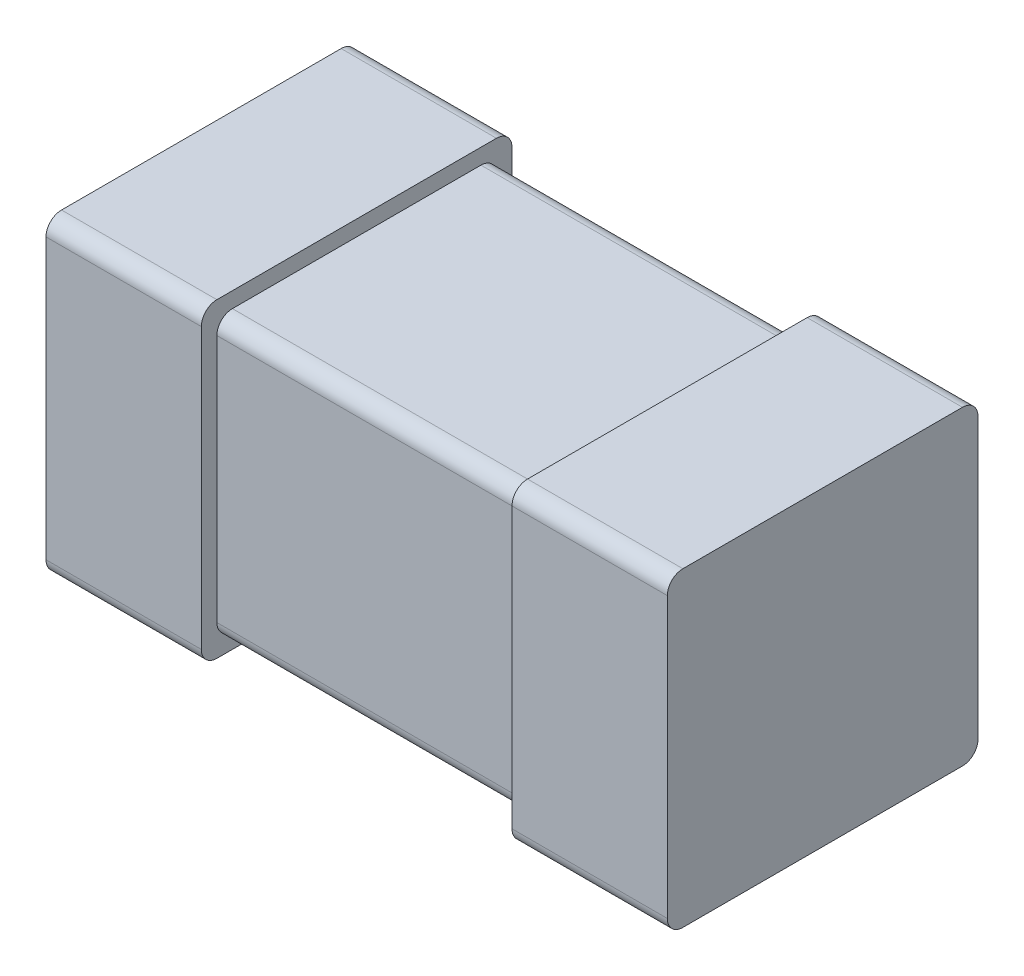
ISO-10303-21;
HEADER;
FILE_DESCRIPTION(('STEP AP214'),'2;1');
FILE_NAME('part.step','',(''),(''),'','','');
FILE_SCHEMA(('AUTOMOTIVE_DESIGN { 1 0 10303 214 1 1 1 1 }'));
ENDSEC;
DATA;
#1=APPLICATION_CONTEXT('core data for automotive mechanical design processes');
#2=APPLICATION_PROTOCOL_DEFINITION('international standard','automotive_design',2000,#1);
#3=PRODUCT_CONTEXT('',#1,'mechanical');
#4=PRODUCT('Part','Part','',(#3));
#5=PRODUCT_RELATED_PRODUCT_CATEGORY('part','',(#4));
#6=PRODUCT_DEFINITION_FORMATION('','',#4);
#7=PRODUCT_DEFINITION_CONTEXT('part definition',#1,'design');
#8=PRODUCT_DEFINITION('design','',#6,#7);
#9=PRODUCT_DEFINITION_SHAPE('','',#8);
#10=(LENGTH_UNIT() NAMED_UNIT(*) SI_UNIT(.MILLI.,.METRE.));
#11=(NAMED_UNIT(*) PLANE_ANGLE_UNIT() SI_UNIT($,.RADIAN.));
#12=(NAMED_UNIT(*) SI_UNIT($,.STERADIAN.) SOLID_ANGLE_UNIT());
#13=UNCERTAINTY_MEASURE_WITH_UNIT(LENGTH_MEASURE(1.E-05),#10,'distance_accuracy_value','');
#14=(GEOMETRIC_REPRESENTATION_CONTEXT(3) GLOBAL_UNCERTAINTY_ASSIGNED_CONTEXT((#13)) GLOBAL_UNIT_ASSIGNED_CONTEXT((#10,
#11,#12)) REPRESENTATION_CONTEXT('',''));
#15=CARTESIAN_POINT('',(0.,0.,0.));
#16=DIRECTION('',(0.,0.,1.));
#17=DIRECTION('',(1.,0.,0.));
#18=AXIS2_PLACEMENT_3D('',#15,#16,#17);
#19=CARTESIAN_POINT('',(-0.3,-0.15,0.));
#20=DIRECTION('',(1.,0.,0.));
#21=DIRECTION('',(0.,0.,1.));
#22=AXIS2_PLACEMENT_3D('',#19,#20,#21);
#23=PLANE('',#22);
#24=CARTESIAN_POINT('',(-0.3,-0.135,0.285));
#25=DIRECTION('',(-1.,0.,0.));
#26=DIRECTION('',(0.,0.,1.));
#27=AXIS2_PLACEMENT_3D('',#24,#25,#26);
#28=CIRCLE('',#27,0.015);
#29=CARTESIAN_POINT('',(-0.3,-0.15,0.285));
#30=VERTEX_POINT('',#29);
#31=CARTESIAN_POINT('',(-0.3,-0.135,0.3));
#32=VERTEX_POINT('',#31);
#33=EDGE_CURVE('E11',#30,#32,#28,.T.);
#34=ORIENTED_EDGE('',*,*,#33,.T.);
#35=DIRECTION('',(0.,1.,0.));
#36=VECTOR('',#35,1.);
#37=CARTESIAN_POINT('',(-0.3,-0.15,0.3));
#38=LINE('',#37,#36);
#39=CARTESIAN_POINT('',(-0.3,0.135,0.3));
#40=VERTEX_POINT('',#39);
#41=EDGE_CURVE('E25',#32,#40,#38,.T.);
#42=ORIENTED_EDGE('',*,*,#41,.T.);
#43=CARTESIAN_POINT('',(-0.3,0.135,0.285));
#44=DIRECTION('',(1.,0.,0.));
#45=DIRECTION('',(0.,0.,1.));
#46=AXIS2_PLACEMENT_3D('',#43,#44,#45);
#47=CIRCLE('',#46,0.015);
#48=CARTESIAN_POINT('',(-0.3,0.15,0.285));
#49=VERTEX_POINT('',#48);
#50=EDGE_CURVE('E450',#49,#40,#47,.T.);
#51=ORIENTED_EDGE('',*,*,#50,.F.);
#52=DIRECTION('',(0.,0.,1.));
#53=VECTOR('',#52,1.);
#54=CARTESIAN_POINT('',(-0.3,0.15,0.));
#55=LINE('',#54,#53);
#56=CARTESIAN_POINT('',(-0.3,0.15,0.015));
#57=VERTEX_POINT('',#56);
#58=EDGE_CURVE('E445',#57,#49,#55,.T.);
#59=ORIENTED_EDGE('',*,*,#58,.F.);
#60=CARTESIAN_POINT('',(-0.3,0.135,0.015));
#61=DIRECTION('',(-1.,0.,0.));
#62=DIRECTION('',(0.,0.,1.));
#63=AXIS2_PLACEMENT_3D('',#60,#61,#62);
#64=CIRCLE('',#63,0.015);
#65=CARTESIAN_POINT('',(-0.3,0.135,0.));
#66=VERTEX_POINT('',#65);
#67=EDGE_CURVE('E441',#57,#66,#64,.T.);
#68=ORIENTED_EDGE('',*,*,#67,.T.);
#69=DIRECTION('',(0.,1.,0.));
#70=VECTOR('',#69,1.);
#71=CARTESIAN_POINT('',(-0.3,-0.15,0.));
#72=LINE('',#71,#70);
#73=CARTESIAN_POINT('',(-0.3,-0.135,0.));
#74=VERTEX_POINT('',#73);
#75=EDGE_CURVE('E436',#74,#66,#72,.T.);
#76=ORIENTED_EDGE('',*,*,#75,.F.);
#77=CARTESIAN_POINT('',(-0.3,-0.135,0.015));
#78=DIRECTION('',(1.,0.,0.));
#79=DIRECTION('',(0.,0.,1.));
#80=AXIS2_PLACEMENT_3D('',#77,#78,#79);
#81=CIRCLE('',#80,0.015);
#82=CARTESIAN_POINT('',(-0.3,-0.15,0.015));
#83=VERTEX_POINT('',#82);
#84=EDGE_CURVE('E431',#83,#74,#81,.T.);
#85=ORIENTED_EDGE('',*,*,#84,.F.);
#86=DIRECTION('',(0.,0.,1.));
#87=VECTOR('',#86,1.);
#88=CARTESIAN_POINT('',(-0.3,-0.15,0.));
#89=LINE('',#88,#87);
#90=EDGE_CURVE('E427',#83,#30,#89,.T.);
#91=ORIENTED_EDGE('',*,*,#90,.T.);
#92=EDGE_LOOP('',(#34,#42,#51,#59,#68,#76,#85,#91));
#93=FACE_BOUND('',#92,.T.);
#94=ADVANCED_FACE('F17',(#93),#23,.F.);
#95=CARTESIAN_POINT('',(-0.3,-0.15,0.));
#96=DIRECTION('',(0.,1.,0.));
#97=DIRECTION('',(0.,0.,1.));
#98=AXIS2_PLACEMENT_3D('',#95,#96,#97);
#99=PLANE('',#98);
#100=DIRECTION('',(1.,0.,0.));
#101=VECTOR('',#100,1.);
#102=CARTESIAN_POINT('',(-0.3,-0.15,0.285));
#103=LINE('',#102,#101);
#104=CARTESIAN_POINT('',(-0.15,-0.15,0.285));
#105=VERTEX_POINT('',#104);
#106=EDGE_CURVE('E422',#30,#105,#103,.T.);
#107=ORIENTED_EDGE('',*,*,#106,.F.);
#108=ORIENTED_EDGE('',*,*,#90,.F.);
#109=DIRECTION('',(1.,0.,0.));
#110=VECTOR('',#109,1.);
#111=CARTESIAN_POINT('',(-0.3,-0.15,0.015));
#112=LINE('',#111,#110);
#113=CARTESIAN_POINT('',(-0.15,-0.15,0.015));
#114=VERTEX_POINT('',#113);
#115=EDGE_CURVE('E418',#83,#114,#112,.T.);
#116=ORIENTED_EDGE('',*,*,#115,.T.);
#117=DIRECTION('',(0.,0.,1.));
#118=VECTOR('',#117,1.);
#119=CARTESIAN_POINT('',(-0.15,-0.15,0.));
#120=LINE('',#119,#118);
#121=EDGE_CURVE('E414',#114,#105,#120,.T.);
#122=ORIENTED_EDGE('',*,*,#121,.T.);
#123=EDGE_LOOP('',(#107,#108,#116,#122));
#124=FACE_BOUND('',#123,.T.);
#125=ADVANCED_FACE('F495',(#124),#99,.F.);
#126=CARTESIAN_POINT('',(-0.15,-0.15,0.));
#127=DIRECTION('',(1.,0.,0.));
#128=DIRECTION('',(0.,0.,1.));
#129=AXIS2_PLACEMENT_3D('',#126,#127,#128);
#130=PLANE('',#129);
#131=ORIENTED_EDGE('',*,*,#121,.F.);
#132=CARTESIAN_POINT('',(-0.15,-0.135,0.015));
#133=DIRECTION('',(1.,0.,0.));
#134=DIRECTION('',(0.,0.,1.));
#135=AXIS2_PLACEMENT_3D('',#132,#133,#134);
#136=CIRCLE('',#135,0.015);
#137=CARTESIAN_POINT('',(-0.15,-0.135,0.));
#138=VERTEX_POINT('',#137);
#139=EDGE_CURVE('E410',#114,#138,#136,.T.);
#140=ORIENTED_EDGE('',*,*,#139,.T.);
#141=DIRECTION('',(0.,1.,0.));
#142=VECTOR('',#141,1.);
#143=CARTESIAN_POINT('',(-0.15,-0.15,0.));
#144=LINE('',#143,#142);
#145=CARTESIAN_POINT('',(-0.15,0.135,0.));
#146=VERTEX_POINT('',#145);
#147=EDGE_CURVE('E406',#138,#146,#144,.T.);
#148=ORIENTED_EDGE('',*,*,#147,.T.);
#149=CARTESIAN_POINT('',(-0.15,0.135,0.015));
#150=DIRECTION('',(-1.,0.,0.));
#151=DIRECTION('',(0.,0.,1.));
#152=AXIS2_PLACEMENT_3D('',#149,#150,#151);
#153=CIRCLE('',#152,0.015);
#154=CARTESIAN_POINT('',(-0.15,0.15,0.015));
#155=VERTEX_POINT('',#154);
#156=EDGE_CURVE('E401',#155,#146,#153,.T.);
#157=ORIENTED_EDGE('',*,*,#156,.F.);
#158=DIRECTION('',(0.,0.,1.));
#159=VECTOR('',#158,1.);
#160=CARTESIAN_POINT('',(-0.15,0.15,0.));
#161=LINE('',#160,#159);
#162=CARTESIAN_POINT('',(-0.15,0.15,0.285));
#163=VERTEX_POINT('',#162);
#164=EDGE_CURVE('E397',#155,#163,#161,.T.);
#165=ORIENTED_EDGE('',*,*,#164,.T.);
#166=CARTESIAN_POINT('',(-0.15,0.135,0.285));
#167=DIRECTION('',(1.,0.,0.));
#168=DIRECTION('',(0.,0.,1.));
#169=AXIS2_PLACEMENT_3D('',#166,#167,#168);
#170=CIRCLE('',#169,0.015);
#171=CARTESIAN_POINT('',(-0.15,0.135,0.3));
#172=VERTEX_POINT('',#171);
#173=EDGE_CURVE('E393',#163,#172,#170,.T.);
#174=ORIENTED_EDGE('',*,*,#173,.T.);
#175=DIRECTION('',(0.,1.,0.));
#176=VECTOR('',#175,1.);
#177=CARTESIAN_POINT('',(-0.15,-0.15,0.3));
#178=LINE('',#177,#176);
#179=CARTESIAN_POINT('',(-0.15,-0.135,0.3));
#180=VERTEX_POINT('',#179);
#181=EDGE_CURVE('E388',#180,#172,#178,.T.);
#182=ORIENTED_EDGE('',*,*,#181,.F.);
#183=CARTESIAN_POINT('',(-0.15,-0.135,0.285));
#184=DIRECTION('',(-1.,0.,0.));
#185=DIRECTION('',(0.,0.,1.));
#186=AXIS2_PLACEMENT_3D('',#183,#184,#185);
#187=CIRCLE('',#186,0.015);
#188=EDGE_CURVE('E383',#105,#180,#187,.T.);
#189=ORIENTED_EDGE('',*,*,#188,.F.);
#190=EDGE_LOOP('',(#131,#140,#148,#157,#165,#174,#182,#189));
#191=FACE_BOUND('',#190,.T.);
#192=CARTESIAN_POINT('',(-0.15,-0.12,0.03));
#193=DIRECTION('',(1.,0.,0.));
#194=DIRECTION('',(0.,0.,1.));
#195=AXIS2_PLACEMENT_3D('',#192,#193,#194);
#196=CIRCLE('',#195,0.015);
#197=CARTESIAN_POINT('',(-0.15,-0.135,0.03));
#198=VERTEX_POINT('',#197);
#199=CARTESIAN_POINT('',(-0.15,-0.12,0.015));
#200=VERTEX_POINT('',#199);
#201=EDGE_CURVE('E378',#198,#200,#196,.T.);
#202=ORIENTED_EDGE('',*,*,#201,.F.);
#203=DIRECTION('',(0.,0.,1.));
#204=VECTOR('',#203,1.);
#205=CARTESIAN_POINT('',(-0.15,-0.135,0.015));
#206=LINE('',#205,#204);
#207=CARTESIAN_POINT('',(-0.15,-0.135,0.27));
#208=VERTEX_POINT('',#207);
#209=EDGE_CURVE('E374',#198,#208,#206,.T.);
#210=ORIENTED_EDGE('',*,*,#209,.T.);
#211=CARTESIAN_POINT('',(-0.15,-0.12,0.27));
#212=DIRECTION('',(-1.,0.,0.));
#213=DIRECTION('',(0.,0.,1.));
#214=AXIS2_PLACEMENT_3D('',#211,#212,#213);
#215=CIRCLE('',#214,0.015);
#216=CARTESIAN_POINT('',(-0.15,-0.12,0.285));
#217=VERTEX_POINT('',#216);
#218=EDGE_CURVE('E370',#208,#217,#215,.T.);
#219=ORIENTED_EDGE('',*,*,#218,.T.);
#220=DIRECTION('',(0.,1.,0.));
#221=VECTOR('',#220,1.);
#222=CARTESIAN_POINT('',(-0.15,-0.135,0.285));
#223=LINE('',#222,#221);
#224=CARTESIAN_POINT('',(-0.15,0.12,0.285));
#225=VERTEX_POINT('',#224);
#226=EDGE_CURVE('E366',#217,#225,#223,.T.);
#227=ORIENTED_EDGE('',*,*,#226,.T.);
#228=CARTESIAN_POINT('',(-0.15,0.12,0.27));
#229=DIRECTION('',(1.,0.,0.));
#230=DIRECTION('',(0.,0.,1.));
#231=AXIS2_PLACEMENT_3D('',#228,#229,#230);
#232=CIRCLE('',#231,0.015);
#233=CARTESIAN_POINT('',(-0.15,0.135,0.27));
#234=VERTEX_POINT('',#233);
#235=EDGE_CURVE('E361',#234,#225,#232,.T.);
#236=ORIENTED_EDGE('',*,*,#235,.F.);
#237=DIRECTION('',(0.,0.,1.));
#238=VECTOR('',#237,1.);
#239=CARTESIAN_POINT('',(-0.15,0.135,0.015));
#240=LINE('',#239,#238);
#241=CARTESIAN_POINT('',(-0.15,0.135,0.03));
#242=VERTEX_POINT('',#241);
#243=EDGE_CURVE('E356',#242,#234,#240,.T.);
#244=ORIENTED_EDGE('',*,*,#243,.F.);
#245=CARTESIAN_POINT('',(-0.15,0.12,0.03));
#246=DIRECTION('',(-1.,0.,0.));
#247=DIRECTION('',(0.,0.,1.));
#248=AXIS2_PLACEMENT_3D('',#245,#246,#247);
#249=CIRCLE('',#248,0.015);
#250=CARTESIAN_POINT('',(-0.15,0.12,0.015));
#251=VERTEX_POINT('',#250);
#252=EDGE_CURVE('E352',#242,#251,#249,.T.);
#253=ORIENTED_EDGE('',*,*,#252,.T.);
#254=DIRECTION('',(0.,1.,0.));
#255=VECTOR('',#254,1.);
#256=CARTESIAN_POINT('',(-0.15,-0.135,0.015));
#257=LINE('',#256,#255);
#258=EDGE_CURVE('E347',#200,#251,#257,.T.);
#259=ORIENTED_EDGE('',*,*,#258,.F.);
#260=EDGE_LOOP('',(#202,#210,#219,#227,#236,#244,#253,#259));
#261=FACE_BOUND('',#260,.T.);
#262=ADVANCED_FACE('F573',(#191,#261),#130,.T.);
#263=CARTESIAN_POINT('',(-0.15,-0.135,0.015));
#264=DIRECTION('',(0.,0.,1.));
#265=DIRECTION('',(1.,0.,0.));
#266=AXIS2_PLACEMENT_3D('',#263,#264,#265);
#267=PLANE('',#266);
#268=DIRECTION('',(1.,0.,0.));
#269=VECTOR('',#268,1.);
#270=CARTESIAN_POINT('',(-0.15,0.12,0.015));
#271=LINE('',#270,#269);
#272=CARTESIAN_POINT('',(0.15,0.12,0.015));
#273=VERTEX_POINT('',#272);
#274=EDGE_CURVE('E343',#251,#273,#271,.T.);
#275=ORIENTED_EDGE('',*,*,#274,.T.);
#276=DIRECTION('',(0.,1.,0.));
#277=VECTOR('',#276,1.);
#278=CARTESIAN_POINT('',(0.15,-0.135,0.015));
#279=LINE('',#278,#277);
#280=CARTESIAN_POINT('',(0.15,-0.12,0.015));
#281=VERTEX_POINT('',#280);
#282=EDGE_CURVE('E338',#281,#273,#279,.T.);
#283=ORIENTED_EDGE('',*,*,#282,.F.);
#284=DIRECTION('',(1.,0.,0.));
#285=VECTOR('',#284,1.);
#286=CARTESIAN_POINT('',(-0.15,-0.12,0.015));
#287=LINE('',#286,#285);
#288=EDGE_CURVE('E333',#200,#281,#287,.T.);
#289=ORIENTED_EDGE('',*,*,#288,.F.);
#290=ORIENTED_EDGE('',*,*,#258,.T.);
#291=EDGE_LOOP('',(#275,#283,#289,#290));
#292=FACE_BOUND('',#291,.T.);
#293=ADVANCED_FACE('F577',(#292),#267,.F.);
#294=CARTESIAN_POINT('',(-0.15,-0.12,0.03));
#295=DIRECTION('',(1.,0.,0.));
#296=DIRECTION('',(0.,0.707106781186547,0.707106781186548));
#297=AXIS2_PLACEMENT_3D('',#294,#295,#296);
#298=CYLINDRICAL_SURFACE('',#297,0.015);
#299=ORIENTED_EDGE('',*,*,#201,.T.);
#300=ORIENTED_EDGE('',*,*,#288,.T.);
#301=CARTESIAN_POINT('',(0.15,-0.12,0.03));
#302=DIRECTION('',(1.,0.,0.));
#303=DIRECTION('',(0.,0.,1.));
#304=AXIS2_PLACEMENT_3D('',#301,#302,#303);
#305=CIRCLE('',#304,0.015);
#306=CARTESIAN_POINT('',(0.15,-0.135,0.03));
#307=VERTEX_POINT('',#306);
#308=EDGE_CURVE('E328',#307,#281,#305,.T.);
#309=ORIENTED_EDGE('',*,*,#308,.F.);
#310=DIRECTION('',(1.,0.,0.));
#311=VECTOR('',#310,1.);
#312=CARTESIAN_POINT('',(-0.15,-0.135,0.03));
#313=LINE('',#312,#311);
#314=EDGE_CURVE('E323',#198,#307,#313,.T.);
#315=ORIENTED_EDGE('',*,*,#314,.F.);
#316=EDGE_LOOP('',(#299,#300,#309,#315));
#317=FACE_BOUND('',#316,.T.);
#318=ADVANCED_FACE('F583',(#317),#298,.T.);
#319=CARTESIAN_POINT('',(-0.15,-0.135,0.015));
#320=DIRECTION('',(0.,1.,0.));
#321=DIRECTION('',(0.,0.,1.));
#322=AXIS2_PLACEMENT_3D('',#319,#320,#321);
#323=PLANE('',#322);
#324=DIRECTION('',(1.,0.,0.));
#325=VECTOR('',#324,1.);
#326=CARTESIAN_POINT('',(-0.15,-0.135,0.27));
#327=LINE('',#326,#325);
#328=CARTESIAN_POINT('',(0.15,-0.135,0.27));
#329=VERTEX_POINT('',#328);
#330=EDGE_CURVE('E318',#208,#329,#327,.T.);
#331=ORIENTED_EDGE('',*,*,#330,.F.);
#332=ORIENTED_EDGE('',*,*,#209,.F.);
#333=ORIENTED_EDGE('',*,*,#314,.T.);
#334=DIRECTION('',(0.,0.,1.));
#335=VECTOR('',#334,1.);
#336=CARTESIAN_POINT('',(0.15,-0.135,0.015));
#337=LINE('',#336,#335);
#338=EDGE_CURVE('E314',#307,#329,#337,.T.);
#339=ORIENTED_EDGE('',*,*,#338,.T.);
#340=EDGE_LOOP('',(#331,#332,#333,#339));
#341=FACE_BOUND('',#340,.T.);
#342=ADVANCED_FACE('F587',(#341),#323,.F.);
#343=CARTESIAN_POINT('',(0.15,-0.15,0.));
#344=DIRECTION('',(1.,0.,0.));
#345=DIRECTION('',(0.,0.,1.));
#346=AXIS2_PLACEMENT_3D('',#343,#344,#345);
#347=PLANE('',#346);
#348=CARTESIAN_POINT('',(0.15,-0.135,0.285));
#349=DIRECTION('',(-1.,0.,0.));
#350=DIRECTION('',(0.,0.,1.));
#351=AXIS2_PLACEMENT_3D('',#348,#349,#350);
#352=CIRCLE('',#351,0.015);
#353=CARTESIAN_POINT('',(0.15,-0.15,0.285));
#354=VERTEX_POINT('',#353);
#355=CARTESIAN_POINT('',(0.15,-0.135,0.3));
#356=VERTEX_POINT('',#355);
#357=EDGE_CURVE('E310',#354,#356,#352,.T.);
#358=ORIENTED_EDGE('',*,*,#357,.T.);
#359=DIRECTION('',(0.,1.,0.));
#360=VECTOR('',#359,1.);
#361=CARTESIAN_POINT('',(0.15,-0.15,0.3));
#362=LINE('',#361,#360);
#363=CARTESIAN_POINT('',(0.15,0.135,0.3));
#364=VERTEX_POINT('',#363);
#365=EDGE_CURVE('E191',#356,#364,#362,.T.);
#366=ORIENTED_EDGE('',*,*,#365,.T.);
#367=CARTESIAN_POINT('',(0.15,0.135,0.285));
#368=DIRECTION('',(1.,0.,0.));
#369=DIRECTION('',(0.,0.,1.));
#370=AXIS2_PLACEMENT_3D('',#367,#368,#369);
#371=CIRCLE('',#370,0.015);
#372=CARTESIAN_POINT('',(0.15,0.15,0.285));
#373=VERTEX_POINT('',#372);
#374=EDGE_CURVE('E302',#373,#364,#371,.T.);
#375=ORIENTED_EDGE('',*,*,#374,.F.);
#376=DIRECTION('',(0.,0.,1.));
#377=VECTOR('',#376,1.);
#378=CARTESIAN_POINT('',(0.15,0.15,0.));
#379=LINE('',#378,#377);
#380=CARTESIAN_POINT('',(0.15,0.15,0.015));
#381=VERTEX_POINT('',#380);
#382=EDGE_CURVE('E297',#381,#373,#379,.T.);
#383=ORIENTED_EDGE('',*,*,#382,.F.);
#384=CARTESIAN_POINT('',(0.15,0.135,0.015));
#385=DIRECTION('',(-1.,0.,0.));
#386=DIRECTION('',(0.,0.,1.));
#387=AXIS2_PLACEMENT_3D('',#384,#385,#386);
#388=CIRCLE('',#387,0.015);
#389=CARTESIAN_POINT('',(0.15,0.135,0.));
#390=VERTEX_POINT('',#389);
#391=EDGE_CURVE('E293',#381,#390,#388,.T.);
#392=ORIENTED_EDGE('',*,*,#391,.T.);
#393=DIRECTION('',(0.,1.,0.));
#394=VECTOR('',#393,1.);
#395=CARTESIAN_POINT('',(0.15,-0.15,0.));
#396=LINE('',#395,#394);
#397=CARTESIAN_POINT('',(0.15,-0.135,0.));
#398=VERTEX_POINT('',#397);
#399=EDGE_CURVE('E288',#398,#390,#396,.T.);
#400=ORIENTED_EDGE('',*,*,#399,.F.);
#401=CARTESIAN_POINT('',(0.15,-0.135,0.015));
#402=DIRECTION('',(1.,0.,0.));
#403=DIRECTION('',(0.,0.,1.));
#404=AXIS2_PLACEMENT_3D('',#401,#402,#403);
#405=CIRCLE('',#404,0.015);
#406=CARTESIAN_POINT('',(0.15,-0.15,0.015));
#407=VERTEX_POINT('',#406);
#408=EDGE_CURVE('E283',#407,#398,#405,.T.);
#409=ORIENTED_EDGE('',*,*,#408,.F.);
#410=DIRECTION('',(0.,0.,1.));
#411=VECTOR('',#410,1.);
#412=CARTESIAN_POINT('',(0.15,-0.15,0.));
#413=LINE('',#412,#411);
#414=EDGE_CURVE('E279',#407,#354,#413,.T.);
#415=ORIENTED_EDGE('',*,*,#414,.T.);
#416=EDGE_LOOP('',(#358,#366,#375,#383,#392,#400,#409,#415));
#417=FACE_BOUND('',#416,.T.);
#418=ORIENTED_EDGE('',*,*,#282,.T.);
#419=CARTESIAN_POINT('',(0.15,0.12,0.03));
#420=DIRECTION('',(-1.,0.,0.));
#421=DIRECTION('',(0.,0.,1.));
#422=AXIS2_PLACEMENT_3D('',#419,#420,#421);
#423=CIRCLE('',#422,0.015);
#424=CARTESIAN_POINT('',(0.15,0.135,0.03));
#425=VERTEX_POINT('',#424);
#426=EDGE_CURVE('E274',#425,#273,#423,.T.);
#427=ORIENTED_EDGE('',*,*,#426,.F.);
#428=DIRECTION('',(0.,0.,1.));
#429=VECTOR('',#428,1.);
#430=CARTESIAN_POINT('',(0.15,0.135,0.015));
#431=LINE('',#430,#429);
#432=CARTESIAN_POINT('',(0.15,0.135,0.27));
#433=VERTEX_POINT('',#432);
#434=EDGE_CURVE('E270',#425,#433,#431,.T.);
#435=ORIENTED_EDGE('',*,*,#434,.T.);
#436=CARTESIAN_POINT('',(0.15,0.12,0.27));
#437=DIRECTION('',(1.,0.,0.));
#438=DIRECTION('',(0.,0.,1.));
#439=AXIS2_PLACEMENT_3D('',#436,#437,#438);
#440=CIRCLE('',#439,0.015);
#441=CARTESIAN_POINT('',(0.15,0.12,0.285));
#442=VERTEX_POINT('',#441);
#443=EDGE_CURVE('E266',#433,#442,#440,.T.);
#444=ORIENTED_EDGE('',*,*,#443,.T.);
#445=DIRECTION('',(0.,1.,0.));
#446=VECTOR('',#445,1.);
#447=CARTESIAN_POINT('',(0.15,-0.135,0.285));
#448=LINE('',#447,#446);
#449=CARTESIAN_POINT('',(0.15,-0.12,0.285));
#450=VERTEX_POINT('',#449);
#451=EDGE_CURVE('E261',#450,#442,#448,.T.);
#452=ORIENTED_EDGE('',*,*,#451,.F.);
#453=CARTESIAN_POINT('',(0.15,-0.12,0.27));
#454=DIRECTION('',(-1.,0.,0.));
#455=DIRECTION('',(0.,0.,1.));
#456=AXIS2_PLACEMENT_3D('',#453,#454,#455);
#457=CIRCLE('',#456,0.015);
#458=EDGE_CURVE('E256',#329,#450,#457,.T.);
#459=ORIENTED_EDGE('',*,*,#458,.F.);
#460=ORIENTED_EDGE('',*,*,#338,.F.);
#461=ORIENTED_EDGE('',*,*,#308,.T.);
#462=EDGE_LOOP('',(#418,#427,#435,#444,#452,#459,#460,#461));
#463=FACE_BOUND('',#462,.T.);
#464=ADVANCED_FACE('F539',(#417,#463),#347,.F.);
#465=CARTESIAN_POINT('',(-0.15,-0.12,0.27));
#466=DIRECTION('',(1.,0.,0.));
#467=DIRECTION('',(0.,0.707106781186547,-0.707106781186548));
#468=AXIS2_PLACEMENT_3D('',#465,#466,#467);
#469=CYLINDRICAL_SURFACE('',#468,0.015);
#470=ORIENTED_EDGE('',*,*,#330,.T.);
#471=ORIENTED_EDGE('',*,*,#458,.T.);
#472=DIRECTION('',(1.,0.,0.));
#473=VECTOR('',#472,1.);
#474=CARTESIAN_POINT('',(-0.15,-0.12,0.285));
#475=LINE('',#474,#473);
#476=EDGE_CURVE('E251',#217,#450,#475,.T.);
#477=ORIENTED_EDGE('',*,*,#476,.F.);
#478=ORIENTED_EDGE('',*,*,#218,.F.);
#479=EDGE_LOOP('',(#470,#471,#477,#478));
#480=FACE_BOUND('',#479,.T.);
#481=ADVANCED_FACE('F594',(#480),#469,.T.);
#482=CARTESIAN_POINT('',(-0.15,-0.135,0.285));
#483=DIRECTION('',(0.,0.,1.));
#484=DIRECTION('',(1.,0.,0.));
#485=AXIS2_PLACEMENT_3D('',#482,#483,#484);
#486=PLANE('',#485);
#487=ORIENTED_EDGE('',*,*,#226,.F.);
#488=ORIENTED_EDGE('',*,*,#476,.T.);
#489=ORIENTED_EDGE('',*,*,#451,.T.);
#490=DIRECTION('',(1.,0.,0.));
#491=VECTOR('',#490,1.);
#492=CARTESIAN_POINT('',(-0.15,0.12,0.285));
#493=LINE('',#492,#491);
#494=EDGE_CURVE('E246',#225,#442,#493,.T.);
#495=ORIENTED_EDGE('',*,*,#494,.F.);
#496=EDGE_LOOP('',(#487,#488,#489,#495));
#497=FACE_BOUND('',#496,.T.);
#498=ADVANCED_FACE('F597',(#497),#486,.T.);
#499=CARTESIAN_POINT('',(-0.15,0.12,0.27));
#500=DIRECTION('',(1.,0.,0.));
#501=DIRECTION('',(0.,-0.707106781186547,-0.707106781186548));
#502=AXIS2_PLACEMENT_3D('',#499,#500,#501);
#503=CYLINDRICAL_SURFACE('',#502,0.015);
#504=ORIENTED_EDGE('',*,*,#235,.T.);
#505=ORIENTED_EDGE('',*,*,#494,.T.);
#506=ORIENTED_EDGE('',*,*,#443,.F.);
#507=DIRECTION('',(1.,0.,0.));
#508=VECTOR('',#507,1.);
#509=CARTESIAN_POINT('',(-0.15,0.135,0.27));
#510=LINE('',#509,#508);
#511=EDGE_CURVE('E241',#234,#433,#510,.T.);
#512=ORIENTED_EDGE('',*,*,#511,.F.);
#513=EDGE_LOOP('',(#504,#505,#506,#512));
#514=FACE_BOUND('',#513,.T.);
#515=ADVANCED_FACE('F601',(#514),#503,.T.);
#516=CARTESIAN_POINT('',(-0.15,0.135,0.015));
#517=DIRECTION('',(0.,1.,0.));
#518=DIRECTION('',(0.,0.,1.));
#519=AXIS2_PLACEMENT_3D('',#516,#517,#518);
#520=PLANE('',#519);
#521=ORIENTED_EDGE('',*,*,#434,.F.);
#522=DIRECTION('',(1.,0.,0.));
#523=VECTOR('',#522,1.);
#524=CARTESIAN_POINT('',(-0.15,0.135,0.03));
#525=LINE('',#524,#523);
#526=EDGE_CURVE('E236',#242,#425,#525,.T.);
#527=ORIENTED_EDGE('',*,*,#526,.F.);
#528=ORIENTED_EDGE('',*,*,#243,.T.);
#529=ORIENTED_EDGE('',*,*,#511,.T.);
#530=EDGE_LOOP('',(#521,#527,#528,#529));
#531=FACE_BOUND('',#530,.T.);
#532=ADVANCED_FACE('F605',(#531),#520,.T.);
#533=CARTESIAN_POINT('',(-0.15,0.12,0.03));
#534=DIRECTION('',(1.,0.,0.));
#535=DIRECTION('',(0.,-0.707106781186547,0.707106781186548));
#536=AXIS2_PLACEMENT_3D('',#533,#534,#535);
#537=CYLINDRICAL_SURFACE('',#536,0.015);
#538=ORIENTED_EDGE('',*,*,#526,.T.);
#539=ORIENTED_EDGE('',*,*,#426,.T.);
#540=ORIENTED_EDGE('',*,*,#274,.F.);
#541=ORIENTED_EDGE('',*,*,#252,.F.);
#542=EDGE_LOOP('',(#538,#539,#540,#541));
#543=FACE_BOUND('',#542,.T.);
#544=ADVANCED_FACE('F609',(#543),#537,.T.);
#545=CARTESIAN_POINT('',(0.15,-0.15,0.));
#546=DIRECTION('',(0.,1.,0.));
#547=DIRECTION('',(0.,0.,1.));
#548=AXIS2_PLACEMENT_3D('',#545,#546,#547);
#549=PLANE('',#548);
#550=DIRECTION('',(1.,0.,0.));
#551=VECTOR('',#550,1.);
#552=CARTESIAN_POINT('',(0.15,-0.15,0.285));
#553=LINE('',#552,#551);
#554=CARTESIAN_POINT('',(0.3,-0.15,0.285));
#555=VERTEX_POINT('',#554);
#556=EDGE_CURVE('E198',#354,#555,#553,.T.);
#557=ORIENTED_EDGE('',*,*,#556,.F.);
#558=ORIENTED_EDGE('',*,*,#414,.F.);
#559=DIRECTION('',(1.,0.,0.));
#560=VECTOR('',#559,1.);
#561=CARTESIAN_POINT('',(0.15,-0.15,0.015));
#562=LINE('',#561,#560);
#563=CARTESIAN_POINT('',(0.3,-0.15,0.015));
#564=VERTEX_POINT('',#563);
#565=EDGE_CURVE('E229',#407,#564,#562,.T.);
#566=ORIENTED_EDGE('',*,*,#565,.T.);
#567=DIRECTION('',(0.,0.,1.));
#568=VECTOR('',#567,1.);
#569=CARTESIAN_POINT('',(0.3,-0.15,0.));
#570=LINE('',#569,#568);
#571=EDGE_CURVE('E225',#564,#555,#570,.T.);
#572=ORIENTED_EDGE('',*,*,#571,.T.);
#573=EDGE_LOOP('',(#557,#558,#566,#572));
#574=FACE_BOUND('',#573,.T.);
#575=ADVANCED_FACE('F545',(#574),#549,.F.);
#576=CARTESIAN_POINT('',(0.3,-0.15,0.));
#577=DIRECTION('',(1.,0.,0.));
#578=DIRECTION('',(0.,0.,1.));
#579=AXIS2_PLACEMENT_3D('',#576,#577,#578);
#580=PLANE('',#579);
#581=ORIENTED_EDGE('',*,*,#571,.F.);
#582=CARTESIAN_POINT('',(0.3,-0.135,0.015));
#583=DIRECTION('',(1.,0.,0.));
#584=DIRECTION('',(0.,0.,1.));
#585=AXIS2_PLACEMENT_3D('',#582,#583,#584);
#586=CIRCLE('',#585,0.015);
#587=CARTESIAN_POINT('',(0.3,-0.135,0.));
#588=VERTEX_POINT('',#587);
#589=EDGE_CURVE('E221',#564,#588,#586,.T.);
#590=ORIENTED_EDGE('',*,*,#589,.T.);
#591=DIRECTION('',(0.,1.,0.));
#592=VECTOR('',#591,1.);
#593=CARTESIAN_POINT('',(0.3,-0.15,0.));
#594=LINE('',#593,#592);
#595=CARTESIAN_POINT('',(0.3,0.135,0.));
#596=VERTEX_POINT('',#595);
#597=EDGE_CURVE('E217',#588,#596,#594,.T.);
#598=ORIENTED_EDGE('',*,*,#597,.T.);
#599=CARTESIAN_POINT('',(0.3,0.135,0.015));
#600=DIRECTION('',(-1.,0.,0.));
#601=DIRECTION('',(0.,0.,1.));
#602=AXIS2_PLACEMENT_3D('',#599,#600,#601);
#603=CIRCLE('',#602,0.015);
#604=CARTESIAN_POINT('',(0.3,0.15,0.015));
#605=VERTEX_POINT('',#604);
#606=EDGE_CURVE('E212',#605,#596,#603,.T.);
#607=ORIENTED_EDGE('',*,*,#606,.F.);
#608=DIRECTION('',(0.,0.,1.));
#609=VECTOR('',#608,1.);
#610=CARTESIAN_POINT('',(0.3,0.15,0.));
#611=LINE('',#610,#609);
#612=CARTESIAN_POINT('',(0.3,0.15,0.285));
#613=VERTEX_POINT('',#612);
#614=EDGE_CURVE('E208',#605,#613,#611,.T.);
#615=ORIENTED_EDGE('',*,*,#614,.T.);
#616=CARTESIAN_POINT('',(0.3,0.135,0.285));
#617=DIRECTION('',(1.,0.,0.));
#618=DIRECTION('',(0.,0.,1.));
#619=AXIS2_PLACEMENT_3D('',#616,#617,#618);
#620=CIRCLE('',#619,0.015);
#621=CARTESIAN_POINT('',(0.3,0.135,0.3));
#622=VERTEX_POINT('',#621);
#623=EDGE_CURVE('E182',#613,#622,#620,.T.);
#624=ORIENTED_EDGE('',*,*,#623,.T.);
#625=DIRECTION('',(0.,1.,0.));
#626=VECTOR('',#625,1.);
#627=CARTESIAN_POINT('',(0.3,-0.15,0.3));
#628=LINE('',#627,#626);
#629=CARTESIAN_POINT('',(0.3,-0.135,0.3));
#630=VERTEX_POINT('',#629);
#631=EDGE_CURVE('E174',#630,#622,#628,.T.);
#632=ORIENTED_EDGE('',*,*,#631,.F.);
#633=CARTESIAN_POINT('',(0.3,-0.135,0.285));
#634=DIRECTION('',(-1.,0.,0.));
#635=DIRECTION('',(0.,0.,1.));
#636=AXIS2_PLACEMENT_3D('',#633,#634,#635);
#637=CIRCLE('',#636,0.015);
#638=EDGE_CURVE('E179',#555,#630,#637,.T.);
#639=ORIENTED_EDGE('',*,*,#638,.F.);
#640=EDGE_LOOP('',(#581,#590,#598,#607,#615,#624,#632,#639));
#641=FACE_BOUND('',#640,.T.);
#642=ADVANCED_FACE('F177',(#641),#580,.T.);
#643=CARTESIAN_POINT('',(0.15,-0.135,0.285));
#644=DIRECTION('',(1.,0.,0.));
#645=DIRECTION('',(0.,0.707106781186547,-0.707106781186548));
#646=AXIS2_PLACEMENT_3D('',#643,#644,#645);
#647=CYLINDRICAL_SURFACE('',#646,0.015);
#648=ORIENTED_EDGE('',*,*,#556,.T.);
#649=ORIENTED_EDGE('',*,*,#638,.T.);
#650=DIRECTION('',(1.,0.,0.));
#651=VECTOR('',#650,1.);
#652=CARTESIAN_POINT('',(0.15,-0.135,0.3));
#653=LINE('',#652,#651);
#654=EDGE_CURVE('E189',#356,#630,#653,.T.);
#655=ORIENTED_EDGE('',*,*,#654,.F.);
#656=ORIENTED_EDGE('',*,*,#357,.F.);
#657=EDGE_LOOP('',(#648,#649,#655,#656));
#658=FACE_BOUND('',#657,.T.);
#659=ADVANCED_FACE('F196',(#658),#647,.T.);
#660=CARTESIAN_POINT('',(0.15,-0.15,0.3));
#661=DIRECTION('',(0.,0.,1.));
#662=DIRECTION('',(1.,0.,0.));
#663=AXIS2_PLACEMENT_3D('',#660,#661,#662);
#664=PLANE('',#663);
#665=ORIENTED_EDGE('',*,*,#365,.F.);
#666=ORIENTED_EDGE('',*,*,#654,.T.);
#667=ORIENTED_EDGE('',*,*,#631,.T.);
#668=DIRECTION('',(1.,0.,0.));
#669=VECTOR('',#668,1.);
#670=CARTESIAN_POINT('',(0.15,0.135,0.3));
#671=LINE('',#670,#669);
#672=EDGE_CURVE('E194',#364,#622,#671,.T.);
#673=ORIENTED_EDGE('',*,*,#672,.F.);
#674=EDGE_LOOP('',(#665,#666,#667,#673));
#675=FACE_BOUND('',#674,.T.);
#676=ADVANCED_FACE('F190',(#675),#664,.T.);
#677=CARTESIAN_POINT('',(0.15,0.135,0.285));
#678=DIRECTION('',(1.,0.,0.));
#679=DIRECTION('',(0.,-0.707106781186547,-0.707106781186548));
#680=AXIS2_PLACEMENT_3D('',#677,#678,#679);
#681=CYLINDRICAL_SURFACE('',#680,0.015);
#682=ORIENTED_EDGE('',*,*,#374,.T.);
#683=ORIENTED_EDGE('',*,*,#672,.T.);
#684=ORIENTED_EDGE('',*,*,#623,.F.);
#685=DIRECTION('',(1.,0.,0.));
#686=VECTOR('',#685,1.);
#687=CARTESIAN_POINT('',(0.15,0.15,0.285));
#688=LINE('',#687,#686);
#689=EDGE_CURVE('E526',#373,#613,#688,.T.);
#690=ORIENTED_EDGE('',*,*,#689,.F.);
#691=EDGE_LOOP('',(#682,#683,#684,#690));
#692=FACE_BOUND('',#691,.T.);
#693=ADVANCED_FACE('F536',(#692),#681,.T.);
#694=CARTESIAN_POINT('',(0.15,0.15,0.));
#695=DIRECTION('',(0.,1.,0.));
#696=DIRECTION('',(0.,0.,1.));
#697=AXIS2_PLACEMENT_3D('',#694,#695,#696);
#698=PLANE('',#697);
#699=ORIENTED_EDGE('',*,*,#614,.F.);
#700=DIRECTION('',(1.,0.,0.));
#701=VECTOR('',#700,1.);
#702=CARTESIAN_POINT('',(0.15,0.15,0.015));
#703=LINE('',#702,#701);
#704=EDGE_CURVE('E521',#381,#605,#703,.T.);
#705=ORIENTED_EDGE('',*,*,#704,.F.);
#706=ORIENTED_EDGE('',*,*,#382,.T.);
#707=ORIENTED_EDGE('',*,*,#689,.T.);
#708=EDGE_LOOP('',(#699,#705,#706,#707));
#709=FACE_BOUND('',#708,.T.);
#710=ADVANCED_FACE('F559',(#709),#698,.T.);
#711=CARTESIAN_POINT('',(0.15,0.135,0.015));
#712=DIRECTION('',(1.,0.,0.));
#713=DIRECTION('',(0.,-0.707106781186547,0.707106781186548));
#714=AXIS2_PLACEMENT_3D('',#711,#712,#713);
#715=CYLINDRICAL_SURFACE('',#714,0.015);
#716=ORIENTED_EDGE('',*,*,#704,.T.);
#717=ORIENTED_EDGE('',*,*,#606,.T.);
#718=DIRECTION('',(1.,0.,0.));
#719=VECTOR('',#718,1.);
#720=CARTESIAN_POINT('',(0.15,0.135,0.));
#721=LINE('',#720,#719);
#722=EDGE_CURVE('E516',#390,#596,#721,.T.);
#723=ORIENTED_EDGE('',*,*,#722,.F.);
#724=ORIENTED_EDGE('',*,*,#391,.F.);
#725=EDGE_LOOP('',(#716,#717,#723,#724));
#726=FACE_BOUND('',#725,.T.);
#727=ADVANCED_FACE('F556',(#726),#715,.T.);
#728=CARTESIAN_POINT('',(0.15,-0.15,0.));
#729=DIRECTION('',(0.,0.,1.));
#730=DIRECTION('',(1.,0.,0.));
#731=AXIS2_PLACEMENT_3D('',#728,#729,#730);
#732=PLANE('',#731);
#733=ORIENTED_EDGE('',*,*,#722,.T.);
#734=ORIENTED_EDGE('',*,*,#597,.F.);
#735=DIRECTION('',(1.,0.,0.));
#736=VECTOR('',#735,1.);
#737=CARTESIAN_POINT('',(0.15,-0.135,0.));
#738=LINE('',#737,#736);
#739=EDGE_CURVE('E502',#398,#588,#738,.T.);
#740=ORIENTED_EDGE('',*,*,#739,.F.);
#741=ORIENTED_EDGE('',*,*,#399,.T.);
#742=EDGE_LOOP('',(#733,#734,#740,#741));
#743=FACE_BOUND('',#742,.T.);
#744=ADVANCED_FACE('F552',(#743),#732,.F.);
#745=CARTESIAN_POINT('',(0.15,-0.135,0.015));
#746=DIRECTION('',(1.,0.,0.));
#747=DIRECTION('',(0.,0.707106781186547,0.707106781186548));
#748=AXIS2_PLACEMENT_3D('',#745,#746,#747);
#749=CYLINDRICAL_SURFACE('',#748,0.015);
#750=ORIENTED_EDGE('',*,*,#408,.T.);
#751=ORIENTED_EDGE('',*,*,#739,.T.);
#752=ORIENTED_EDGE('',*,*,#589,.F.);
#753=ORIENTED_EDGE('',*,*,#565,.F.);
#754=EDGE_LOOP('',(#750,#751,#752,#753));
#755=FACE_BOUND('',#754,.T.);
#756=ADVANCED_FACE('F550',(#755),#749,.T.);
#757=CARTESIAN_POINT('',(-0.3,-0.135,0.285));
#758=DIRECTION('',(1.,0.,0.));
#759=DIRECTION('',(0.,0.707106781186547,-0.707106781186548));
#760=AXIS2_PLACEMENT_3D('',#757,#758,#759);
#761=CYLINDRICAL_SURFACE('',#760,0.015);
#762=ORIENTED_EDGE('',*,*,#106,.T.);
#763=ORIENTED_EDGE('',*,*,#188,.T.);
#764=DIRECTION('',(1.,0.,0.));
#765=VECTOR('',#764,1.);
#766=CARTESIAN_POINT('',(-0.3,-0.135,0.3));
#767=LINE('',#766,#765);
#768=EDGE_CURVE('E500',#32,#180,#767,.T.);
#769=ORIENTED_EDGE('',*,*,#768,.F.);
#770=ORIENTED_EDGE('',*,*,#33,.F.);
#771=EDGE_LOOP('',(#762,#763,#769,#770));
#772=FACE_BOUND('',#771,.T.);
#773=ADVANCED_FACE('F498',(#772),#761,.T.);
#774=CARTESIAN_POINT('',(-0.3,-0.15,0.3));
#775=DIRECTION('',(0.,0.,1.));
#776=DIRECTION('',(1.,0.,0.));
#777=AXIS2_PLACEMENT_3D('',#774,#775,#776);
#778=PLANE('',#777);
#779=ORIENTED_EDGE('',*,*,#41,.F.);
#780=ORIENTED_EDGE('',*,*,#768,.T.);
#781=ORIENTED_EDGE('',*,*,#181,.T.);
#782=DIRECTION('',(1.,0.,0.));
#783=VECTOR('',#782,1.);
#784=CARTESIAN_POINT('',(-0.3,0.135,0.3));
#785=LINE('',#784,#783);
#786=EDGE_CURVE('E464',#40,#172,#785,.T.);
#787=ORIENTED_EDGE('',*,*,#786,.F.);
#788=EDGE_LOOP('',(#779,#780,#781,#787));
#789=FACE_BOUND('',#788,.T.);
#790=ADVANCED_FACE('F504',(#789),#778,.T.);
#791=CARTESIAN_POINT('',(-0.3,0.135,0.285));
#792=DIRECTION('',(1.,0.,0.));
#793=DIRECTION('',(0.,-0.707106781186547,-0.707106781186548));
#794=AXIS2_PLACEMENT_3D('',#791,#792,#793);
#795=CYLINDRICAL_SURFACE('',#794,0.015);
#796=ORIENTED_EDGE('',*,*,#50,.T.);
#797=ORIENTED_EDGE('',*,*,#786,.T.);
#798=ORIENTED_EDGE('',*,*,#173,.F.);
#799=DIRECTION('',(1.,0.,0.));
#800=VECTOR('',#799,1.);
#801=CARTESIAN_POINT('',(-0.3,0.15,0.285));
#802=LINE('',#801,#800);
#803=EDGE_CURVE('E466',#49,#163,#802,.T.);
#804=ORIENTED_EDGE('',*,*,#803,.F.);
#805=EDGE_LOOP('',(#796,#797,#798,#804));
#806=FACE_BOUND('',#805,.T.);
#807=ADVANCED_FACE('F462',(#806),#795,.T.);
#808=CARTESIAN_POINT('',(-0.3,0.15,0.));
#809=DIRECTION('',(0.,1.,0.));
#810=DIRECTION('',(0.,0.,1.));
#811=AXIS2_PLACEMENT_3D('',#808,#809,#810);
#812=PLANE('',#811);
#813=ORIENTED_EDGE('',*,*,#164,.F.);
#814=DIRECTION('',(1.,0.,0.));
#815=VECTOR('',#814,1.);
#816=CARTESIAN_POINT('',(-0.3,0.15,0.015));
#817=LINE('',#816,#815);
#818=EDGE_CURVE('E473',#57,#155,#817,.T.);
#819=ORIENTED_EDGE('',*,*,#818,.F.);
#820=ORIENTED_EDGE('',*,*,#58,.T.);
#821=ORIENTED_EDGE('',*,*,#803,.T.);
#822=EDGE_LOOP('',(#813,#819,#820,#821));
#823=FACE_BOUND('',#822,.T.);
#824=ADVANCED_FACE('F474',(#823),#812,.T.);
#825=CARTESIAN_POINT('',(-0.3,0.135,0.015));
#826=DIRECTION('',(1.,0.,0.));
#827=DIRECTION('',(0.,-0.707106781186547,0.707106781186548));
#828=AXIS2_PLACEMENT_3D('',#825,#826,#827);
#829=CYLINDRICAL_SURFACE('',#828,0.015);
#830=ORIENTED_EDGE('',*,*,#818,.T.);
#831=ORIENTED_EDGE('',*,*,#156,.T.);
#832=DIRECTION('',(1.,0.,0.));
#833=VECTOR('',#832,1.);
#834=CARTESIAN_POINT('',(-0.3,0.135,0.));
#835=LINE('',#834,#833);
#836=EDGE_CURVE('E476',#66,#146,#835,.T.);
#837=ORIENTED_EDGE('',*,*,#836,.F.);
#838=ORIENTED_EDGE('',*,*,#67,.F.);
#839=EDGE_LOOP('',(#830,#831,#837,#838));
#840=FACE_BOUND('',#839,.T.);
#841=ADVANCED_FACE('F478',(#840),#829,.T.);
#842=CARTESIAN_POINT('',(-0.3,-0.15,0.));
#843=DIRECTION('',(0.,0.,1.));
#844=DIRECTION('',(1.,0.,0.));
#845=AXIS2_PLACEMENT_3D('',#842,#843,#844);
#846=PLANE('',#845);
#847=ORIENTED_EDGE('',*,*,#836,.T.);
#848=ORIENTED_EDGE('',*,*,#147,.F.);
#849=DIRECTION('',(1.,0.,0.));
#850=VECTOR('',#849,1.);
#851=CARTESIAN_POINT('',(-0.3,-0.135,0.));
#852=LINE('',#851,#850);
#853=EDGE_CURVE('E482',#74,#138,#852,.T.);
#854=ORIENTED_EDGE('',*,*,#853,.F.);
#855=ORIENTED_EDGE('',*,*,#75,.T.);
#856=EDGE_LOOP('',(#847,#848,#854,#855));
#857=FACE_BOUND('',#856,.T.);
#858=ADVANCED_FACE('F485',(#857),#846,.F.);
#859=CARTESIAN_POINT('',(-0.3,-0.135,0.015));
#860=DIRECTION('',(1.,0.,0.));
#861=DIRECTION('',(0.,0.707106781186547,0.707106781186548));
#862=AXIS2_PLACEMENT_3D('',#859,#860,#861);
#863=CYLINDRICAL_SURFACE('',#862,0.015);
#864=ORIENTED_EDGE('',*,*,#84,.T.);
#865=ORIENTED_EDGE('',*,*,#853,.T.);
#866=ORIENTED_EDGE('',*,*,#139,.F.);
#867=ORIENTED_EDGE('',*,*,#115,.F.);
#868=EDGE_LOOP('',(#864,#865,#866,#867));
#869=FACE_BOUND('',#868,.T.);
#870=ADVANCED_FACE('F492',(#869),#863,.T.);
#871=CLOSED_SHELL('',(#94,#125,#262,#293,#318,#342,#464,#481,#498,#515,#532,#544,#575,#642,#659,
#676,#693,#710,#727,#744,#756,#773,#790,#807,#824,#841,#858,#870));
#872=MANIFOLD_SOLID_BREP('B1',#871);
#873=ADVANCED_BREP_SHAPE_REPRESENTATION('',(#18,#872),#14);
#874=SHAPE_DEFINITION_REPRESENTATION(#9,#873);
ENDSEC;
END-ISO-10303-21;
